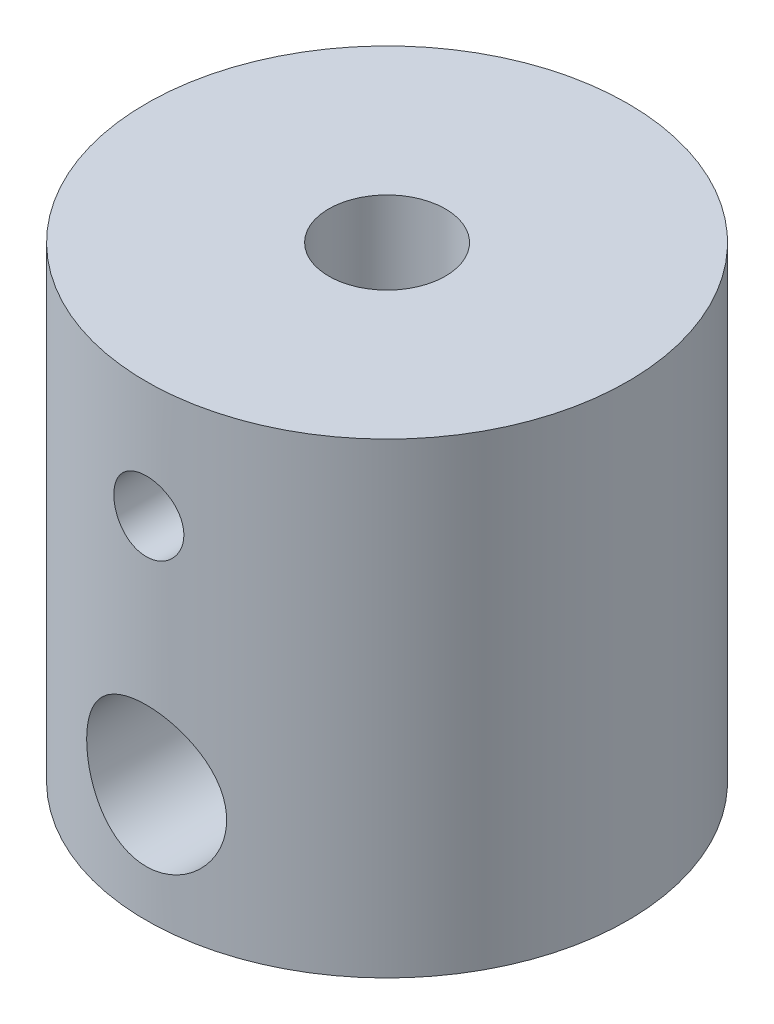
ISO-10303-21;
HEADER;
FILE_DESCRIPTION(('STEP AP214'),'2;1');
FILE_NAME('part.step','',(''),(''),'','','');
FILE_SCHEMA(('AUTOMOTIVE_DESIGN { 1 0 10303 214 1 1 1 1 }'));
ENDSEC;
DATA;
#1=APPLICATION_CONTEXT('core data for automotive mechanical design processes');
#2=APPLICATION_PROTOCOL_DEFINITION('international standard','automotive_design',2000,#1);
#3=PRODUCT_CONTEXT('',#1,'mechanical');
#4=PRODUCT('Part','Part','',(#3));
#5=PRODUCT_RELATED_PRODUCT_CATEGORY('part','',(#4));
#6=PRODUCT_DEFINITION_FORMATION('','',#4);
#7=PRODUCT_DEFINITION_CONTEXT('part definition',#1,'design');
#8=PRODUCT_DEFINITION('design','',#6,#7);
#9=PRODUCT_DEFINITION_SHAPE('','',#8);
#10=(LENGTH_UNIT() NAMED_UNIT(*) SI_UNIT(.MILLI.,.METRE.));
#11=(NAMED_UNIT(*) PLANE_ANGLE_UNIT() SI_UNIT($,.RADIAN.));
#12=(NAMED_UNIT(*) SI_UNIT($,.STERADIAN.) SOLID_ANGLE_UNIT());
#13=UNCERTAINTY_MEASURE_WITH_UNIT(LENGTH_MEASURE(1.E-05),#10,'distance_accuracy_value','');
#14=(GEOMETRIC_REPRESENTATION_CONTEXT(3) GLOBAL_UNCERTAINTY_ASSIGNED_CONTEXT((#13)) GLOBAL_UNIT_ASSIGNED_CONTEXT((#10,
#11,#12)) REPRESENTATION_CONTEXT('',''));
#15=CARTESIAN_POINT('',(0.,0.,0.));
#16=DIRECTION('',(0.,0.,1.));
#17=DIRECTION('',(1.,0.,0.));
#18=AXIS2_PLACEMENT_3D('',#15,#16,#17);
#19=CARTESIAN_POINT('',(0.,0.,0.));
#20=DIRECTION('',(0.,-1.,0.));
#21=DIRECTION('',(0.,0.,-1.));
#22=AXIS2_PLACEMENT_3D('',#19,#20,#21);
#23=CYLINDRICAL_SURFACE('',#22,5.);
#24=CARTESIAN_POINT('',(0.,10.,0.));
#25=DIRECTION('',(0.,-1.,0.));
#26=DIRECTION('',(0.,0.,-1.));
#27=AXIS2_PLACEMENT_3D('',#24,#25,#26);
#28=CIRCLE('',#27,5.);
#29=CARTESIAN_POINT('',(0.,10.,-5.));
#30=VERTEX_POINT('',#29);
#31=EDGE_CURVE('E127',#30,#30,#28,.T.);
#32=ORIENTED_EDGE('',*,*,#31,.F.);
#33=EDGE_LOOP('',(#32));
#34=FACE_BOUND('',#33,.T.);
#35=CARTESIAN_POINT('',(0.,0.,0.));
#36=DIRECTION('',(0.,-1.,0.));
#37=DIRECTION('',(0.,0.,-1.));
#38=AXIS2_PLACEMENT_3D('',#35,#36,#37);
#39=CIRCLE('',#38,5.);
#40=CARTESIAN_POINT('',(0.,0.,-5.));
#41=VERTEX_POINT('',#40);
#42=EDGE_CURVE('E61',#41,#41,#39,.T.);
#43=ORIENTED_EDGE('',*,*,#42,.T.);
#44=EDGE_LOOP('',(#43));
#45=FACE_BOUND('',#44,.T.);
#46=CARTESIAN_POINT('',(-3.,5.,4.));
#47=CARTESIAN_POINT('',(-2.9999999059924,5.07546161036566,3.99999997094658));
#48=CARTESIAN_POINT('',(-2.99714660074499,5.15091995182571,4.00214560778386));
#49=CARTESIAN_POINT('',(-2.98579602023829,5.30118357915588,4.01061905841259));
#50=CARTESIAN_POINT('',(-2.97729658251829,5.37598860368072,4.01694847458097));
#51=CARTESIAN_POINT('',(-2.94350195877,5.59854240080013,4.04185988554313));
#52=CARTESIAN_POINT('',(-2.90991036792577,5.74446616303865,4.06636523363867));
#53=CARTESIAN_POINT('',(-2.82286888064331,6.02619529387303,4.1272446631328));
#54=CARTESIAN_POINT('',(-2.76956233581238,6.16206540972156,4.16353284212727));
#55=CARTESIAN_POINT('',(-2.64505893939301,6.42286717142596,4.24371857831163));
#56=CARTESIAN_POINT('',(-2.57385675138361,6.54779553947816,4.28761840405594));
#57=CARTESIAN_POINT('',(-2.40542341931062,6.79990131024536,4.3845721143975));
#58=CARTESIAN_POINT('',(-2.30607419983945,6.92548608074574,4.43808896832273));
#59=CARTESIAN_POINT('',(-2.08854542159202,7.15952535636891,4.54452303763808));
#60=CARTESIAN_POINT('',(-1.97035175093534,7.26796690142325,4.59743977155758));
#61=CARTESIAN_POINT('',(-1.70284578042267,7.47628246871424,4.70351798165429));
#62=CARTESIAN_POINT('',(-1.55155129309906,7.57396641364106,4.75608869625048));
#63=CARTESIAN_POINT('',(-1.31132430439157,7.69974650858797,4.82570563669468));
#64=CARTESIAN_POINT('',(-1.22900736782604,7.73822411545812,4.84737661360987));
#65=CARTESIAN_POINT('',(-1.06047221299631,7.80779096487914,4.88701002756048));
#66=CARTESIAN_POINT('',(-0.974256618946846,7.83888509171157,4.90497491519086));
#67=CARTESIAN_POINT('',(-0.806968026671437,7.89062746245329,4.9351119388654));
#68=CARTESIAN_POINT('',(-0.726184158740189,7.9119872715291,4.94767216447126));
#69=CARTESIAN_POINT('',(-0.562666348744432,7.94794996135096,4.96892323787741));
#70=CARTESIAN_POINT('',(-0.479933520527565,7.9625566076376,4.97761624192487));
#71=CARTESIAN_POINT('',(-0.313244621267395,7.98478468451609,4.99087754875312));
#72=CARTESIAN_POINT('',(-0.229289227265367,7.9924098423118,4.99544805239181));
#73=CARTESIAN_POINT('',(-0.0609397888852066,8.00056663984718,5.00033941607428));
#74=CARTESIAN_POINT('',(0.0234542099897581,8.00109900129356,5.00066070848407));
#75=CARTESIAN_POINT('',(0.255171183646356,7.99275721772026,4.99565270087357));
#76=CARTESIAN_POINT('',(0.402219957267168,7.97652885035085,4.98590479614142));
#77=CARTESIAN_POINT('',(0.690956248818425,7.92304450631758,4.95416390550291));
#78=CARTESIAN_POINT('',(0.832643369131343,7.8857869733895,4.9321700133334));
#79=CARTESIAN_POINT('',(1.10810607069191,7.79166776699805,4.87769707511975));
#80=CARTESIAN_POINT('',(1.2418309672266,7.73469357980008,4.84515792140775));
#81=CARTESIAN_POINT('',(1.49797933560354,7.60323106554831,4.77219304045846));
#82=CARTESIAN_POINT('',(1.62039986081242,7.52873818986414,4.73176526544935));
#83=CARTESIAN_POINT('',(1.86614789799246,7.35432172038148,4.64075842839173));
#84=CARTESIAN_POINT('',(1.98783715480756,7.2524233514645,4.58954363323803));
#85=CARTESIAN_POINT('',(2.2134294892317,7.03119178989514,4.48511110796774));
#86=CARTESIAN_POINT('',(2.31730807434112,6.91183500028095,4.43189074054161));
#87=CARTESIAN_POINT('',(2.51649670159325,6.64269317960225,4.32222149525339));
#88=CARTESIAN_POINT('',(2.60941864927586,6.4909848446704,4.26611322583746));
#89=CARTESIAN_POINT('',(2.76794435835452,6.17058753897334,4.16501759300692));
#90=CARTESIAN_POINT('',(2.83359844351372,6.00193056868576,4.12000980621702));
#91=CARTESIAN_POINT('',(2.92154993808436,5.69521273550437,4.05791730375361));
#92=CARTESIAN_POINT('',(2.95055806318484,5.55991873420767,4.03667777278559));
#93=CARTESIAN_POINT('',(2.98961745817055,5.28525278059874,4.00784301513237));
#94=CARTESIAN_POINT('',(2.9996907751055,5.1458857631155,4.00023192044755));
#95=CARTESIAN_POINT('',(3.00029561322377,4.86689663103837,3.9997782882838));
#96=CARTESIAN_POINT('',(2.99080006076193,4.72727443039828,4.00695621149423));
#97=CARTESIAN_POINT('',(2.95280584471632,4.45202532768623,4.03503040875294));
#98=CARTESIAN_POINT('',(2.92429216045109,4.31640167218009,4.05593752603304));
#99=CARTESIAN_POINT('',(2.84976612867927,4.05257078445052,4.10863539286051));
#100=CARTESIAN_POINT('',(2.80377564381491,3.92435451586245,4.14041253958232));
#101=CARTESIAN_POINT('',(2.69592568264801,3.67704477969248,4.21143069058874));
#102=CARTESIAN_POINT('',(2.63406022035171,3.5579547754061,4.25067450889246));
#103=CARTESIAN_POINT('',(2.48334675803862,3.3095189047537,4.34073681424694));
#104=CARTESIAN_POINT('',(2.391645038527,3.18219456767056,4.39236652981539));
#105=CARTESIAN_POINT('',(2.18975614095891,2.94343279605459,4.49643335252963));
#106=CARTESIAN_POINT('',(2.07955127457131,2.83201075390556,4.54887118822612));
#107=CARTESIAN_POINT('',(1.82651475528323,2.61353600868425,4.65671991538655));
#108=CARTESIAN_POINT('',(1.68130397020029,2.50893529423711,4.71163080343122));
#109=CARTESIAN_POINT('',(1.44944631278512,2.37184550227661,4.78599458202112));
#110=CARTESIAN_POINT('',(1.36978605711653,2.32943799786309,4.80945640676867));
#111=CARTESIAN_POINT('',(1.20623656162325,2.25169611652151,4.85305400686526));
#112=CARTESIAN_POINT('',(1.12235002598574,2.2163572868813,4.87319187464059));
#113=CARTESIAN_POINT('',(0.957140698774941,2.15552035676558,4.90820667253681));
#114=CARTESIAN_POINT('',(0.876069467337989,2.12949628153821,4.9233583127873));
#115=CARTESIAN_POINT('',(0.711460619981308,2.08433501839092,4.94982497459132));
#116=CARTESIAN_POINT('',(0.627924414708837,2.06519397112009,4.96114214594589));
#117=CARTESIAN_POINT('',(0.459119615082284,2.0340996902869,4.9795990393125));
#118=CARTESIAN_POINT('',(0.37385224130405,2.02214156263945,4.98674160560362));
#119=CARTESIAN_POINT('',(0.202384159163477,2.00559323834099,4.99664216975595));
#120=CARTESIAN_POINT('',(0.116183573945421,2.00100208121105,4.99940073918633));
#121=CARTESIAN_POINT('',(-0.119519384080578,1.99867171024059,5.00079353601933));
#122=CARTESIAN_POINT('',(-0.269213134971584,2.0083989254259,4.9949361975757));
#123=CARTESIAN_POINT('',(-0.564325544477554,2.04978205414894,4.97026391444784));
#124=CARTESIAN_POINT('',(-0.709744155455479,2.08143821194009,4.95144882543497));
#125=CARTESIAN_POINT('',(-0.990283617430275,2.16444057064628,4.90298726022977));
#126=CARTESIAN_POINT('',(-1.1255320564868,2.215463439549,4.87351900635897));
#127=CARTESIAN_POINT('',(-1.38556595318151,2.33528094176348,4.8060670798365));
#128=CARTESIAN_POINT('',(-1.51034905620296,2.40407956034356,4.76808149787885));
#129=CARTESIAN_POINT('',(-1.76052652812014,2.56584990689575,4.68186861678971));
#130=CARTESIAN_POINT('',(-1.88451663454097,2.66063506352805,4.63297714592576));
#131=CARTESIAN_POINT('',(-2.11579577789689,2.86750842456549,4.5320378935883));
#132=CARTESIAN_POINT('',(-2.22306604531463,2.97961579766439,4.47998665474642));
#133=CARTESIAN_POINT('',(-2.43181699852643,3.23456104337874,4.37056449731607));
#134=CARTESIAN_POINT('',(-2.53083841179814,3.37949308448909,4.31335603990194));
#135=CARTESIAN_POINT('',(-2.70314606061125,3.68700957259526,4.20752457767503));
#136=CARTESIAN_POINT('',(-2.77644567607668,3.84958478419803,4.15889711577767));
#137=CARTESIAN_POINT('',(-2.86193484914579,4.09662255268763,4.10004730463765));
#138=CARTESIAN_POINT('',(-2.88571236613332,4.17565859129722,4.0832950867822));
#139=CARTESIAN_POINT('',(-2.92679381745552,4.33613044180016,4.05395087655969));
#140=CARTESIAN_POINT('',(-2.94410184772356,4.41756469998732,4.04135625254712));
#141=CARTESIAN_POINT('',(-2.97191221271433,4.58204655069406,4.0209497222627));
#142=CARTESIAN_POINT('',(-2.98242533831514,4.66509136837172,4.01313023377049));
#143=CARTESIAN_POINT('',(-2.99646884485439,4.83209221666361,4.00265571377826));
#144=CARTESIAN_POINT('',(-3.00000010458449,4.91604813126241,4.00000003232225));
#145=CARTESIAN_POINT('',(-3.,5.,4.));
#146=B_SPLINE_CURVE_WITH_KNOTS('',3,(#46,#47,#48,#49,#50,#51,#52,#53,#54,#55,#56,#57,#58,#59,
#60,#61,#62,#63,#64,#65,#66,#67,#68,#69,#70,#71,#72,#73,#74,#75,#76,#77,#78,#79,#80,#81,#82,#83,
#84,#85,#86,#87,#88,#89,#90,#91,#92,#93,#94,#95,#96,#97,#98,#99,#100,#101,#102,#103,#104,#105,
#106,#107,#108,#109,#110,#111,#112,#113,#114,#115,#116,#117,#118,#119,#120,#121,#122,#123,#124,
#125,#126,#127,#128,#129,#130,#131,#132,#133,#134,#135,#136,#137,#138,#139,#140,#141,#142,#143,
#144,#145),.UNSPECIFIED.,.T.,.F.,(4,2,2,2,2,2,2,2,2,2,2,2,2,2,2,2,2,2,2,2,2,2,2,2,2,2,2,2,2,2,2,
2,2,2,2,2,2,2,2,2,2,2,2,2,2,2,2,2,2,4),(0.,0.226288173517879,0.452663065091108,
0.905305714765857,1.35471981612576,1.80426809059901,2.30878181396805,2.81367513819685,
3.37309572088444,3.65297634398311,3.93267130287329,4.18580566749444,4.43879871451846,
4.69165661737851,4.94448879122708,5.38694235003539,5.82942865693065,6.27448283989929,
6.71965270654932,7.21799594026829,7.71701907227943,8.27387316194679,8.82969494223662,
9.24786570023494,9.66554925202079,10.0838110593649,10.5024036052238,10.9204742264512,
11.3387027222345,11.8323285087813,12.3264288987103,12.884776299373,13.1641700331408,
13.4433872125907,13.7024631857776,13.9613936663243,14.2201475237758,14.4788676430947,
14.9267946196281,15.3747265854331,15.8154875864153,16.2563474905318,16.7450674536299,
17.2343321574792,17.7856420979722,18.3366648323362,18.5890061072372,18.8411873492279,
19.0929671157917,19.3447151893882),.UNSPECIFIED.);
#147=CARTESIAN_POINT('',(-3.,5.,4.));
#148=VERTEX_POINT('',#147);
#149=EDGE_CURVE('E99',#148,#148,#146,.T.);
#150=ORIENTED_EDGE('',*,*,#149,.F.);
#151=EDGE_LOOP('',(#150));
#152=FACE_BOUND('',#151,.T.);
#153=ADVANCED_FACE('F49',(#34,#45,#152),#23,.F.);
#154=CARTESIAN_POINT('',(0.,0.,0.));
#155=DIRECTION('',(0.,-1.,0.));
#156=DIRECTION('',(0.,0.,-1.));
#157=AXIS2_PLACEMENT_3D('',#154,#155,#156);
#158=CYLINDRICAL_SURFACE('',#157,10.31875);
#159=CARTESIAN_POINT('',(0.,0.,0.));
#160=DIRECTION('',(0.,-1.,0.));
#161=DIRECTION('',(0.,0.,-1.));
#162=AXIS2_PLACEMENT_3D('',#159,#160,#161);
#163=CIRCLE('',#162,10.31875);
#164=CARTESIAN_POINT('',(0.,0.,-10.31875));
#165=VERTEX_POINT('',#164);
#166=EDGE_CURVE('E65',#165,#165,#163,.T.);
#167=ORIENTED_EDGE('',*,*,#166,.F.);
#168=EDGE_LOOP('',(#167));
#169=FACE_BOUND('',#168,.T.);
#170=CARTESIAN_POINT('',(0.,20.,0.));
#171=DIRECTION('',(0.,-1.,0.));
#172=DIRECTION('',(0.,0.,-1.));
#173=AXIS2_PLACEMENT_3D('',#170,#171,#172);
#174=CIRCLE('',#173,10.31875);
#175=CARTESIAN_POINT('',(0.,20.,-10.31875));
#176=VERTEX_POINT('',#175);
#177=EDGE_CURVE('E70',#176,#176,#174,.T.);
#178=ORIENTED_EDGE('',*,*,#177,.T.);
#179=EDGE_LOOP('',(#178));
#180=FACE_BOUND('',#179,.T.);
#181=CARTESIAN_POINT('',(0.,13.5,10.31875));
#182=CARTESIAN_POINT('',(0.0837819607339596,13.5000034776501,10.318748686599));
#183=CARTESIAN_POINT('',(0.167613281912517,13.5070431087532,10.3177189020575));
#184=CARTESIAN_POINT('',(0.332934794385833,13.5350096902615,10.3137099847073));
#185=CARTESIAN_POINT('',(0.414422590295902,13.5559503573273,10.3107289265461));
#186=CARTESIAN_POINT('',(0.572640425147574,13.611081833009,10.3031526306588));
#187=CARTESIAN_POINT('',(0.649373933886186,13.6452628431548,10.2985585868519));
#188=CARTESIAN_POINT('',(0.7960037629053,13.72588126249,10.2882646154186));
#189=CARTESIAN_POINT('',(0.865901074759324,13.772316890553,10.2825648485334));
#190=CARTESIAN_POINT('',(0.997400776906768,13.876490538446,10.2706468892861));
#191=CARTESIAN_POINT('',(1.05894560433755,13.934300866438,10.2644255345824));
#192=CARTESIAN_POINT('',(1.17149683095147,14.059427331708,10.2521904826792));
#193=CARTESIAN_POINT('',(1.22250263841507,14.1267440023682,10.2461767971553));
#194=CARTESIAN_POINT('',(1.31275022390557,14.2693566653012,10.2350072332995));
#195=CARTESIAN_POINT('',(1.35193664144488,14.3446880382892,10.2298554405714));
#196=CARTESIAN_POINT('',(1.41707935548035,14.5009504893511,10.2210359010739));
#197=CARTESIAN_POINT('',(1.44303632888573,14.5818812806796,10.2173680783763));
#198=CARTESIAN_POINT('',(1.48080527979091,14.7464412641317,10.2119627100376));
#199=CARTESIAN_POINT('',(1.49271556425705,14.8300474449268,10.2102117553026));
#200=CARTESIAN_POINT('',(1.50235752535367,14.998088690434,10.2087976098725));
#201=CARTESIAN_POINT('',(1.5000899672862,15.082523710161,10.2091343064887));
#202=CARTESIAN_POINT('',(1.48152101950504,15.2491332506721,10.2118451564076));
#203=CARTESIAN_POINT('',(1.46532887870183,15.3313202426047,10.2142034483061));
#204=CARTESIAN_POINT('',(1.41954130718723,15.4917982243243,10.2206670007986));
#205=CARTESIAN_POINT('',(1.38994551847912,15.5700891099885,10.2247723080532));
#206=CARTESIAN_POINT('',(1.31807639017003,15.7208862732386,10.2342849419976));
#207=CARTESIAN_POINT('',(1.27575653818824,15.7933700705531,10.2396970310405));
#208=CARTESIAN_POINT('',(1.1796737418992,15.9302488373677,10.2512099375101));
#209=CARTESIAN_POINT('',(1.12591009161906,15.9946433074437,10.2573107974164));
#210=CARTESIAN_POINT('',(1.00786501804294,16.1141488556154,10.2695840038803));
#211=CARTESIAN_POINT('',(0.943489617746688,16.1691671338979,10.2757564839731));
#212=CARTESIAN_POINT('',(0.806369370664086,16.2676327185068,10.2874241983379));
#213=CARTESIAN_POINT('',(0.733624491146089,16.3110799795787,10.2929194299611));
#214=CARTESIAN_POINT('',(0.58175157226227,16.3851740539305,10.3026187289702));
#215=CARTESIAN_POINT('',(0.502620123593875,16.4158139757,10.3068221008972));
#216=CARTESIAN_POINT('',(0.340260297529394,16.4633443380821,10.3134581796291));
#217=CARTESIAN_POINT('',(0.257032180462146,16.4802356511773,10.3158909987916));
#218=CARTESIAN_POINT('',(0.0896427745060789,16.4996665366038,10.3186970347258));
#219=CARTESIAN_POINT('',(0.00549659682360666,16.5023337398306,10.3190885669576));
#220=CARTESIAN_POINT('',(-0.162041766537512,16.4935790776358,10.317817690034));
#221=CARTESIAN_POINT('',(-0.245433974027722,16.4821576211064,10.3161553404881));
#222=CARTESIAN_POINT('',(-0.408712587049516,16.4456559681444,10.3109748191207));
#223=CARTESIAN_POINT('',(-0.48861312456975,16.4206376900583,10.3074650624411));
#224=CARTESIAN_POINT('',(-0.64308534216285,16.3577176832638,10.2989821042169));
#225=CARTESIAN_POINT('',(-0.717656785100219,16.31981538167,10.2940088375989));
#226=CARTESIAN_POINT('',(-0.859916982007754,16.2319019492633,10.2831063049776));
#227=CARTESIAN_POINT('',(-0.92755501348206,16.1818095385581,10.2771707150889));
#228=CARTESIAN_POINT('',(-1.05350980648317,16.0710513491078,10.2650246016984));
#229=CARTESIAN_POINT('',(-1.11182606056964,16.0103849951349,10.258814063253));
#230=CARTESIAN_POINT('',(-1.21794403448247,15.8796339782862,10.2467602483491));
#231=CARTESIAN_POINT('',(-1.26566038193787,15.8094796836956,10.2409202067074));
#232=CARTESIAN_POINT('',(-1.34863136154721,15.6620768663482,10.2303251129395));
#233=CARTESIAN_POINT('',(-1.38388631405051,15.5848285260248,10.225570032923));
#234=CARTESIAN_POINT('',(-1.44080024657093,15.4256891229112,10.2177064181395));
#235=CARTESIAN_POINT('',(-1.46250478771679,15.3438146387155,10.2145923712242));
#236=CARTESIAN_POINT('',(-1.49184716298129,15.1775341423672,10.2103485299712));
#237=CARTESIAN_POINT('',(-1.49948590447492,15.0931282938683,10.2092186076391));
#238=CARTESIAN_POINT('',(-1.50045923509721,14.9250316213542,10.2090755283487));
#239=CARTESIAN_POINT('',(-1.49392803047329,14.8413415602766,10.2100425111611));
#240=CARTESIAN_POINT('',(-1.46703378739175,14.676263256137,10.2139412181737));
#241=CARTESIAN_POINT('',(-1.4466707658538,14.5948750102596,10.2168729399705));
#242=CARTESIAN_POINT('',(-1.39273731548527,14.4367439955743,10.2243640090385));
#243=CARTESIAN_POINT('',(-1.35917569527644,14.3599981677941,10.2289222705847));
#244=CARTESIAN_POINT('',(-1.27981102487928,14.2132050383744,10.2391542230725));
#245=CARTESIAN_POINT('',(-1.2340076112631,14.143157935687,10.2448279471282));
#246=CARTESIAN_POINT('',(-1.13096980910404,14.011067871719,10.2567156077661));
#247=CARTESIAN_POINT('',(-1.07363587406262,13.9491029516819,10.2629339622892));
#248=CARTESIAN_POINT('',(-0.949374737227707,13.8356254923594,10.2751729201099));
#249=CARTESIAN_POINT('',(-0.882445303334387,13.7841153918221,10.2811934769942));
#250=CARTESIAN_POINT('',(-0.74048874256042,13.6927743664313,10.292393750887));
#251=CARTESIAN_POINT('',(-0.665421658441391,13.6530050037279,10.2975689743244));
#252=CARTESIAN_POINT('',(-0.509634972677335,13.5866975599105,10.3064512211945));
#253=CARTESIAN_POINT('',(-0.428921384273434,13.5601456403503,10.3101597793617));
#254=CARTESIAN_POINT('',(-0.289861820830573,13.5271169837284,10.3148347928169));
#255=CARTESIAN_POINT('',(-0.232378193461981,13.5169634683008,10.3162955330485));
#256=CARTESIAN_POINT('',(-0.116604342148973,13.5034038043583,10.3182535882664));
#257=CARTESIAN_POINT('',(-0.0583141273410549,13.4999975794774,10.3187509141566));
#258=CARTESIAN_POINT('',(0.,13.5,10.31875));
#259=B_SPLINE_CURVE_WITH_KNOTS('',3,(#181,#182,#183,#184,#185,#186,#187,#188,#189,#190,#191,
#192,#193,#194,#195,#196,#197,#198,#199,#200,#201,#202,#203,#204,#205,#206,#207,#208,#209,#210,
#211,#212,#213,#214,#215,#216,#217,#218,#219,#220,#221,#222,#223,#224,#225,#226,#227,#228,#229,
#230,#231,#232,#233,#234,#235,#236,#237,#238,#239,#240,#241,#242,#243,#244,#245,#246,#247,#248,
#249,#250,#251,#252,#253,#254,#255,#256,#257,#258),.UNSPECIFIED.,.T.,.F.,(4,2,2,2,2,2,2,2,2,2,2,
2,2,2,2,2,2,2,2,2,2,2,2,2,2,2,2,2,2,2,2,2,2,2,2,2,2,2,4),(0.,0.251132813055181,
0.502513797115294,0.753709101870635,1.00486791716148,1.25767815751196,1.51050258818905,
1.7644934555948,2.01847132577833,2.27066095833277,2.52283697812665,2.77305235098082,
3.02327440720741,3.27442249811505,3.52558608695035,3.77910692814728,4.03262876085601,
4.28628683624193,4.53992881330884,4.79129102017873,5.04264593198696,5.29286567853072,
5.54309655249654,5.79504394528558,6.04700504841755,6.30092728037056,6.55484298418271,
6.80790027216983,7.06094123503463,7.31159606870804,7.56225059577,7.81273812145553,
8.06323308430789,8.31599142575106,8.5688086593928,8.82292890019706,9.07678251872959,
9.25157857819687,9.42637265930605),.UNSPECIFIED.);
#260=CARTESIAN_POINT('',(0.,13.5,10.31875));
#261=VERTEX_POINT('',#260);
#262=EDGE_CURVE('E80',#261,#261,#259,.T.);
#263=ORIENTED_EDGE('',*,*,#262,.F.);
#264=EDGE_LOOP('',(#263));
#265=FACE_BOUND('',#264,.T.);
#266=CARTESIAN_POINT('',(0.,2.,10.31875));
#267=CARTESIAN_POINT('',(0.164809339708518,2.00000260411524,10.3187482156861));
#268=CARTESIAN_POINT('',(0.329645236370561,2.01362625223754,10.3147634656808));
#269=CARTESIAN_POINT('',(0.65453164201993,2.06764112286197,10.2992560877628));
#270=CARTESIAN_POINT('',(0.81458045299665,2.10804172835734,10.2877308175722));
#271=CARTESIAN_POINT('',(1.12515880789111,2.21415837713034,10.2584079399792));
#272=CARTESIAN_POINT('',(1.27570153997501,2.27983840917499,10.2406192580346));
#273=CARTESIAN_POINT('',(1.56363701331181,2.43450585262916,10.200627348723));
#274=CARTESIAN_POINT('',(1.70102824471204,2.52349593576811,10.1784236153861));
#275=CARTESIAN_POINT('',(1.9624883297935,2.72480309347405,10.1313046885095));
#276=CARTESIAN_POINT('',(2.08614980938856,2.83763684958135,10.1063365130543));
#277=CARTESIAN_POINT('',(2.31308869397159,3.08232631327685,10.0568256112728));
#278=CARTESIAN_POINT('',(2.41636291630475,3.21418498529229,10.0322829519185));
#279=CARTESIAN_POINT('',(2.60169339010749,3.49657152878148,9.98584688734821));
#280=CARTESIAN_POINT('',(2.68326071618413,3.64743217407339,9.96401962363506));
#281=CARTESIAN_POINT('',(2.81970476394612,3.96146537475487,9.92627391883909));
#282=CARTESIAN_POINT('',(2.87458745682366,4.12463516629099,9.91035415603));
#283=CARTESIAN_POINT('',(2.95465094193823,4.45409763274911,9.88677660234138));
#284=CARTESIAN_POINT('',(2.98057928672853,4.62019340716631,9.87891132751446));
#285=CARTESIAN_POINT('',(3.00433142331236,4.95454926035329,9.87171524575314));
#286=CARTESIAN_POINT('',(3.00216156245194,5.12280884174261,9.87238251132915));
#287=CARTESIAN_POINT('',(2.97036785822354,5.45070945042278,9.8819917000496));
#288=CARTESIAN_POINT('',(2.94167105481681,5.61044989367503,9.89065419738246));
#289=CARTESIAN_POINT('',(2.85913208579218,5.92274380747966,9.91482709518641));
#290=CARTESIAN_POINT('',(2.80528757485632,6.07529660623893,9.93033813435678));
#291=CARTESIAN_POINT('',(2.67327821241828,6.37119505794485,9.96668986679346));
#292=CARTESIAN_POINT('',(2.59480575119463,6.51439492322032,9.98759734133766));
#293=CARTESIAN_POINT('',(2.41598201759831,6.78590899337859,10.032353012791));
#294=CARTESIAN_POINT('',(2.31562572355983,6.91421977130317,10.0562018841135));
#295=CARTESIAN_POINT('',(2.09123959519477,7.15758300323984,10.1052951210385));
#296=CARTESIAN_POINT('',(1.96643769283189,7.27192110249352,10.1305575942754));
#297=CARTESIAN_POINT('',(1.69911725268762,7.47820594227385,10.1788026416105));
#298=CARTESIAN_POINT('',(1.55659773152913,7.57015143910998,10.2017850890335));
#299=CARTESIAN_POINT('',(1.25664515614381,7.72943961629529,10.2430693038246));
#300=CARTESIAN_POINT('',(1.09912823116441,7.79663230325611,10.2613423397371));
#301=CARTESIAN_POINT('',(0.774376783585014,7.90336585193613,10.2909418456767));
#302=CARTESIAN_POINT('',(0.607144812826127,7.94291393978165,10.3022701309233));
#303=CARTESIAN_POINT('',(0.27378998917986,7.99206603214321,10.316420244371));
#304=CARTESIAN_POINT('',(0.107821475672511,8.00263903563725,10.3195172365743));
#305=CARTESIAN_POINT('',(-0.223525049255154,7.9962452510305,10.3176584164921));
#306=CARTESIAN_POINT('',(-0.388903131695083,7.97928189521353,10.3127036078273));
#307=CARTESIAN_POINT('',(-0.710774438262296,7.91908404940463,10.2954774370871));
#308=CARTESIAN_POINT('',(-0.867381284338873,7.87640834016098,10.2833617978582));
#309=CARTESIAN_POINT('',(-1.17118421651959,7.76666269437771,10.2532069748765));
#310=CARTESIAN_POINT('',(-1.31837919598625,7.69958989543239,10.2351670960824));
#311=CARTESIAN_POINT('',(-1.602803533405,7.54127876614574,10.1945443185533));
#312=CARTESIAN_POINT('',(-1.73973949104261,7.44953750529714,10.1718695417646));
#313=CARTESIAN_POINT('',(-1.99660615335673,7.24511064246976,10.1245864910467));
#314=CARTESIAN_POINT('',(-2.11653284033902,7.13242010662035,10.0999777624325));
#315=CARTESIAN_POINT('',(-2.34019207722368,6.88474724770741,10.050556358394));
#316=CARTESIAN_POINT('',(-2.44323650274532,6.74913794232412,10.0257651294251));
#317=CARTESIAN_POINT('',(-2.62514498957025,6.46201590773114,9.97968201140453));
#318=CARTESIAN_POINT('',(-2.704009828135,6.31050368993646,9.95839000987919));
#319=CARTESIAN_POINT('',(-2.83475572157265,5.99645904468501,9.92196416824371));
#320=CARTESIAN_POINT('',(-2.8867744786621,5.83398778772747,9.9067989905632));
#321=CARTESIAN_POINT('',(-2.96257912826892,5.50207448386907,9.88439775474818));
#322=CARTESIAN_POINT('',(-2.98637395748199,5.33263466105477,9.87715918682391));
#323=CARTESIAN_POINT('',(-3.00447352362688,4.99871141814798,9.87166744941792));
#324=CARTESIAN_POINT('',(-2.99989517109239,4.83429331176663,9.87307394847626));
#325=CARTESIAN_POINT('',(-2.96402270838302,4.50868041251158,9.88390177599681));
#326=CARTESIAN_POINT('',(-2.93272954968522,4.34748550504937,9.89332281901222));
#327=CARTESIAN_POINT('',(-2.84501664544716,4.03459859768704,9.91889704675834));
#328=CARTESIAN_POINT('',(-2.78887556389646,3.8828219205278,9.93497544521476));
#329=CARTESIAN_POINT('',(-2.65327633068819,3.59072151730623,9.97204314168065));
#330=CARTESIAN_POINT('',(-2.57381393250293,3.45039988302059,9.99303333392673));
#331=CARTESIAN_POINT('',(-2.39061947255502,3.17996638200597,10.0384622597086));
#332=CARTESIAN_POINT('',(-2.28614566389075,3.05037273687777,10.0629948803548));
#333=CARTESIAN_POINT('',(-2.05725079751584,2.8101940672653,10.112270010532));
#334=CARTESIAN_POINT('',(-1.93282467071614,2.6996138881794,10.1370125718836));
#335=CARTESIAN_POINT('',(-1.66352720565006,2.49765014410651,10.1847164671136));
#336=CARTESIAN_POINT('',(-1.51819628961165,2.40686232244762,10.207612064002));
#337=CARTESIAN_POINT('',(-1.21366777641137,2.25114191236074,10.2482752317567));
#338=CARTESIAN_POINT('',(-1.05447743613254,2.18619589105942,10.2660454655223));
#339=CARTESIAN_POINT('',(-0.747027153378267,2.09060356082421,10.2926848278426));
#340=CARTESIAN_POINT('',(-0.599839856567203,2.05671532871959,10.3023813373372));
#341=CARTESIAN_POINT('',(-0.301775436038093,2.01141398268262,10.3154142799912));
#342=CARTESIAN_POINT('',(-0.150898849590458,1.99999761568128,10.3187516337115));
#343=CARTESIAN_POINT('',(0.,2.,10.31875));
#344=B_SPLINE_CURVE_WITH_KNOTS('',3,(#266,#267,#268,#269,#270,#271,#272,#273,#274,#275,#276,
#277,#278,#279,#280,#281,#282,#283,#284,#285,#286,#287,#288,#289,#290,#291,#292,#293,#294,#295,
#296,#297,#298,#299,#300,#301,#302,#303,#304,#305,#306,#307,#308,#309,#310,#311,#312,#313,#314,
#315,#316,#317,#318,#319,#320,#321,#322,#323,#324,#325,#326,#327,#328,#329,#330,#331,#332,#333,
#334,#335,#336,#337,#338,#339,#340,#341,#342,#343),.UNSPECIFIED.,.T.,.F.,(4,2,2,2,2,2,2,2,2,2,2,
2,2,2,2,2,2,2,2,2,2,2,2,2,2,2,2,2,2,2,2,2,2,2,2,2,2,2,4),(0.,0.493873997059169,
0.987921145535341,1.48126709971997,1.97466962452711,2.48012375385357,2.98565672733546,
3.50176243882254,4.01775260866783,4.52008841990524,5.02231075615293,5.50761954578886,
5.99297360518815,6.48464880908287,6.97643695624753,7.4874496173683,7.99849065378578,
8.51257937497536,9.02653366626779,9.52307728083395,10.0195590082152,10.5056218670792,
10.9917417720136,11.4886423401052,11.9856600843868,12.4995537381869,13.0134308709597,
13.5246452884892,14.0356977941717,14.5267639721703,15.0178126610388,15.5034886332393,
15.9892530960444,16.4917511925501,16.9943771566599,17.5105105150347,18.0263752295891,
18.4786299917694,18.9308192798927),.UNSPECIFIED.);
#345=CARTESIAN_POINT('',(0.,2.,10.31875));
#346=VERTEX_POINT('',#345);
#347=EDGE_CURVE('E10',#346,#346,#344,.T.);
#348=ORIENTED_EDGE('',*,*,#347,.F.);
#349=EDGE_LOOP('',(#348));
#350=FACE_BOUND('',#349,.T.);
#351=ADVANCED_FACE('F104',(#169,#180,#265,#350),#158,.T.);
#352=CARTESIAN_POINT('',(0.,0.,0.));
#353=DIRECTION('',(0.,-1.,0.));
#354=DIRECTION('',(0.,0.,-1.));
#355=AXIS2_PLACEMENT_3D('',#352,#353,#354);
#356=CYLINDRICAL_SURFACE('',#355,2.5);
#357=CARTESIAN_POINT('',(0.,20.,0.));
#358=DIRECTION('',(0.,-1.,0.));
#359=DIRECTION('',(0.,0.,-1.));
#360=AXIS2_PLACEMENT_3D('',#357,#358,#359);
#361=CIRCLE('',#360,2.5);
#362=CARTESIAN_POINT('',(0.,20.,-2.5));
#363=VERTEX_POINT('',#362);
#364=EDGE_CURVE('E135',#363,#363,#361,.T.);
#365=ORIENTED_EDGE('',*,*,#364,.F.);
#366=EDGE_LOOP('',(#365));
#367=FACE_BOUND('',#366,.T.);
#368=CARTESIAN_POINT('',(0.,10.,0.));
#369=DIRECTION('',(0.,-1.,0.));
#370=DIRECTION('',(0.,0.,-1.));
#371=AXIS2_PLACEMENT_3D('',#368,#369,#370);
#372=CIRCLE('',#371,2.5);
#373=CARTESIAN_POINT('',(0.,10.,-2.5));
#374=VERTEX_POINT('',#373);
#375=EDGE_CURVE('E132',#374,#374,#372,.T.);
#376=ORIENTED_EDGE('',*,*,#375,.T.);
#377=EDGE_LOOP('',(#376));
#378=FACE_BOUND('',#377,.T.);
#379=CARTESIAN_POINT('',(-1.5,15.,2.));
#380=CARTESIAN_POINT('',(-1.50000404108592,15.0754789752896,1.99999416642511));
#381=CARTESIAN_POINT('',(-1.49426852824013,15.1509384340798,2.00433633903481));
#382=CARTESIAN_POINT('',(-1.47174965152787,15.2993239039622,2.02092590613883));
#383=CARTESIAN_POINT('',(-1.45495475788936,15.3722471873851,2.03318155043097));
#384=CARTESIAN_POINT('',(-1.41143486335795,15.5130836416773,2.0636233903473));
#385=CARTESIAN_POINT('',(-1.3847815450315,15.5810288380353,2.0817666618312));
#386=CARTESIAN_POINT('',(-1.32252909283019,15.7114374533679,2.12185904995836));
#387=CARTESIAN_POINT('',(-1.28692729054693,15.7738992296951,2.14380930122416));
#388=CARTESIAN_POINT('',(-1.20271292747644,15.8999490166641,2.19228594587542));
#389=CARTESIAN_POINT('',(-1.15304179435289,15.9627409571239,2.21904371037662));
#390=CARTESIAN_POINT('',(-1.04426801309985,16.0797647627418,2.27226229431061));
#391=CARTESIAN_POINT('',(-0.985158296729613,16.1339901516708,2.29872287517103));
#392=CARTESIAN_POINT('',(-0.851442367411701,16.2381338097097,2.35175567858734));
#393=CARTESIAN_POINT('',(-0.775851995162547,16.2869544636698,2.37803133577818));
#394=CARTESIAN_POINT('',(-0.615654228271656,16.3708097224444,2.42443786983179));
#395=CARTESIAN_POINT('',(-0.531055196626328,16.4058569741227,2.44457437988735));
#396=CARTESIAN_POINT('',(-0.363771406742664,16.4575959228127,2.4747098780044));
#397=CARTESIAN_POINT('',(-0.281674698130913,16.4757203609673,2.4854930393917));
#398=CARTESIAN_POINT('',(-0.114970509382706,16.4979428028631,2.49874939277545));
#399=CARTESIAN_POINT('',(-0.0303654624001517,16.5020539780001,2.50123038813308));
#400=CARTESIAN_POINT('',(0.127637283737311,16.4963862526575,2.49783372711539));
#401=CARTESIAN_POINT('',(0.201123832865636,16.4882664738307,2.49295437513726));
#402=CARTESIAN_POINT('',(0.345464269151769,16.4615202043519,2.47707997553857));
#403=CARTESIAN_POINT('',(0.416317961051203,16.4428929360928,2.46608447529309));
#404=CARTESIAN_POINT('',(0.554056780469081,16.3958344372962,2.43884907201719));
#405=CARTESIAN_POINT('',(0.620916491037619,16.367346938861,2.42257910450824));
#406=CARTESIAN_POINT('',(0.748988660115613,16.3016153837745,2.38609637638748));
#407=CARTESIAN_POINT('',(0.810199646208012,16.264369052941,2.36588259201812));
#408=CARTESIAN_POINT('',(0.933074267143201,16.1771609071955,2.32037925976362));
#409=CARTESIAN_POINT('',(0.993918663198195,16.1262116882643,2.2947718295215));
#410=CARTESIAN_POINT('',(1.10671465909275,16.0155958821398,2.24255554245601));
#411=CARTESIAN_POINT('',(1.1586540130834,15.9559174965255,2.21594536703375));
#412=CARTESIAN_POINT('',(1.25824837767417,15.8213465938364,2.16111075123946));
#413=CARTESIAN_POINT('',(1.30470933188632,15.7454924234605,2.13305661385124));
#414=CARTESIAN_POINT('',(1.38397217194232,15.5852937683634,2.08250879557267));
#415=CARTESIAN_POINT('',(1.41679921962189,15.5009652838744,2.0600049029882));
#416=CARTESIAN_POINT('',(1.46077497064842,15.3476063681047,2.02895865196731));
#417=CARTESIAN_POINT('',(1.47527903312665,15.2799593677034,2.01833888618316));
#418=CARTESIAN_POINT('',(1.49480872755284,15.1426263897005,2.00392150777558));
#419=CARTESIAN_POINT('',(1.49984538302907,15.0729428795154,2.00011596115116));
#420=CARTESIAN_POINT('',(1.50014781114183,14.9334483175643,1.99988914321323));
#421=CARTESIAN_POINT('',(1.49540004697659,14.8636372227848,2.00347810223984));
#422=CARTESIAN_POINT('',(1.47640290574941,14.7260126562514,2.01751520788652));
#423=CARTESIAN_POINT('',(1.46214601830139,14.6582008077597,2.02796877613213));
#424=CARTESIAN_POINT('',(1.42488312618657,14.5262854205202,2.054317683331));
#425=CARTESIAN_POINT('',(1.40188805257362,14.4621773634678,2.07020622092812));
#426=CARTESIAN_POINT('',(1.34796261057072,14.3385222842698,2.10571539417587));
#427=CARTESIAN_POINT('',(1.31702924888212,14.278976993634,2.12533743689999));
#428=CARTESIAN_POINT('',(1.24167439558512,14.1547599174878,2.17036819177737));
#429=CARTESIAN_POINT('',(1.19582663060303,14.0910991649034,2.19618239397369));
#430=CARTESIAN_POINT('',(1.09487395518701,13.9717145151505,2.2482175480362));
#431=CARTESIAN_POINT('',(1.03976018672402,13.9159983078309,2.27443886711455));
#432=CARTESIAN_POINT('',(0.913274837212766,13.8067759926496,2.32835625910913));
#433=CARTESIAN_POINT('',(0.840721108780191,13.7544992733942,2.3558007587587));
#434=CARTESIAN_POINT('',(0.686103100868019,13.6630972231633,2.40537639133459));
#435=CARTESIAN_POINT('',(0.604045176134702,13.6239631721591,2.42751104449411));
#436=CARTESIAN_POINT('',(0.438840232972138,13.5631317965686,2.46252280092775));
#437=CARTESIAN_POINT('',(0.356205963651258,13.5403737722089,2.47595588067329));
#438=CARTESIAN_POINT('',(0.187383063890857,13.5092853971537,2.494407389061));
#439=CARTESIAN_POINT('',(0.101198571781968,13.5009387092824,2.49943534582737));
#440=CARTESIAN_POINT('',(-0.0598120232009846,13.4993253914141,2.50040600461976));
#441=CARTESIAN_POINT('',(-0.134620583589707,13.504196665437,2.49747057186327));
#442=CARTESIAN_POINT('',(-0.282148755978774,13.5248938243816,2.48512948412095));
#443=CARTESIAN_POINT('',(-0.354868344701915,13.5407198313216,2.47572375706639));
#444=CARTESIAN_POINT('',(-0.495145481978797,13.5822195715838,2.45149427526962));
#445=CARTESIAN_POINT('',(-0.56276703260883,13.6077315961292,2.43675966858906));
#446=CARTESIAN_POINT('',(-0.692781971999984,13.6676405945548,2.40303337447155));
#447=CARTESIAN_POINT('',(-0.755174184199832,13.7020395608596,2.38404073252268));
#448=CARTESIAN_POINT('',(-0.880263645295947,13.7829251965688,2.34093432659381));
#449=CARTESIAN_POINT('',(-0.94225869043994,13.8303187090169,2.31648844639149));
#450=CARTESIAN_POINT('',(-1.05789751536307,13.9337530337177,2.26601907350661));
#451=CARTESIAN_POINT('',(-1.11153190956916,13.9898034256079,2.23999385274509));
#452=CARTESIAN_POINT('',(-1.2159097535057,14.1172855621777,2.18528165666204));
#453=CARTESIAN_POINT('',(-1.26542406663367,14.1897664861655,2.15667566270901));
#454=CARTESIAN_POINT('',(-1.35156817210325,14.3434848527665,2.10376464485145));
#455=CARTESIAN_POINT('',(-1.38820466322661,14.4247177139814,2.07945738811052));
#456=CARTESIAN_POINT('',(-1.44437116535132,14.5870642851372,2.0408000304796));
#457=CARTESIAN_POINT('',(-1.46509526060187,14.6675952359613,2.02577665830138));
#458=CARTESIAN_POINT('',(-1.49289268240426,14.8320973947037,2.00539032320036));
#459=CARTESIAN_POINT('',(-1.49999550595837,14.9160607657587,2.00000648744643));
#460=CARTESIAN_POINT('',(-1.5,15.,2.));
#461=B_SPLINE_CURVE_WITH_KNOTS('',3,(#379,#380,#381,#382,#383,#384,#385,#386,#387,#388,#389,
#390,#391,#392,#393,#394,#395,#396,#397,#398,#399,#400,#401,#402,#403,#404,#405,#406,#407,#408,
#409,#410,#411,#412,#413,#414,#415,#416,#417,#418,#419,#420,#421,#422,#423,#424,#425,#426,#427,
#428,#429,#430,#431,#432,#433,#434,#435,#436,#437,#438,#439,#440,#441,#442,#443,#444,#445,#446,
#447,#448,#449,#450,#451,#452,#453,#454,#455,#456,#457,#458,#459,#460),.UNSPECIFIED.,.T.,.F.,(4,
2,2,2,2,2,2,2,2,2,2,2,2,2,2,2,2,2,2,2,2,2,2,2,2,2,2,2,2,2,2,2,2,2,2,2,2,2,2,2,4),(0.,
0.226085249493392,0.452406574330771,0.677113624991878,0.901887762215932,1.15414462390001,
1.40659128601844,1.68630157736223,1.9657544327122,2.21853330858497,2.47107452602767,
2.69230130543182,2.91354445887945,3.13607155036377,3.35865648368879,3.60782810055849,
3.85733966656908,4.13576671140276,4.41367760154768,4.62276298054684,4.83160475643976,
5.04073566011181,5.25003193304128,5.45906724365495,5.66818149154661,5.91499438482002,
6.16204457978454,6.44121828011589,6.72020638384848,6.97891479383337,7.23732973022726,
7.46129321849399,7.68525920139648,7.90563970188756,8.12606965394584,8.37042963549487,
8.61506198741955,8.89071695766604,9.16622832484805,9.41820120134354,9.66962780912277),.UNSPECIFIED.);
#462=CARTESIAN_POINT('',(-1.5,15.,2.));
#463=VERTEX_POINT('',#462);
#464=EDGE_CURVE('E73',#463,#463,#461,.T.);
#465=ORIENTED_EDGE('',*,*,#464,.F.);
#466=EDGE_LOOP('',(#465));
#467=FACE_BOUND('',#466,.T.);
#468=ADVANCED_FACE('F81',(#367,#378,#467),#356,.F.);
#469=CARTESIAN_POINT('',(-10.31875,0.,0.));
#470=DIRECTION('',(0.,1.,0.));
#471=DIRECTION('',(0.,0.,1.));
#472=AXIS2_PLACEMENT_3D('',#469,#470,#471);
#473=PLANE('',#472);
#474=ORIENTED_EDGE('',*,*,#42,.F.);
#475=EDGE_LOOP('',(#474));
#476=FACE_BOUND('',#475,.T.);
#477=ORIENTED_EDGE('',*,*,#166,.T.);
#478=EDGE_LOOP('',(#477));
#479=FACE_BOUND('',#478,.T.);
#480=ADVANCED_FACE('F109',(#476,#479),#473,.F.);
#481=CARTESIAN_POINT('',(-2.5,20.,0.));
#482=DIRECTION('',(0.,-1.,0.));
#483=DIRECTION('',(0.,0.,-1.));
#484=AXIS2_PLACEMENT_3D('',#481,#482,#483);
#485=PLANE('',#484);
#486=ORIENTED_EDGE('',*,*,#177,.F.);
#487=EDGE_LOOP('',(#486));
#488=FACE_BOUND('',#487,.T.);
#489=ORIENTED_EDGE('',*,*,#364,.T.);
#490=EDGE_LOOP('',(#489));
#491=FACE_BOUND('',#490,.T.);
#492=ADVANCED_FACE('F108',(#488,#491),#485,.F.);
#493=CARTESIAN_POINT('',(-5.,10.,0.));
#494=DIRECTION('',(0.,1.,0.));
#495=DIRECTION('',(0.,0.,1.));
#496=AXIS2_PLACEMENT_3D('',#493,#494,#495);
#497=PLANE('',#496);
#498=ORIENTED_EDGE('',*,*,#375,.F.);
#499=EDGE_LOOP('',(#498));
#500=FACE_BOUND('',#499,.T.);
#501=ORIENTED_EDGE('',*,*,#31,.T.);
#502=EDGE_LOOP('',(#501));
#503=FACE_BOUND('',#502,.T.);
#504=ADVANCED_FACE('F89',(#500,#503),#497,.F.);
#505=CARTESIAN_POINT('',(0.,15.,10.31875));
#506=DIRECTION('',(0.,0.,-1.));
#507=DIRECTION('',(-1.,0.,0.));
#508=AXIS2_PLACEMENT_3D('',#505,#506,#507);
#509=CYLINDRICAL_SURFACE('',#508,1.5);
#510=ORIENTED_EDGE('',*,*,#464,.T.);
#511=EDGE_LOOP('',(#510));
#512=FACE_BOUND('',#511,.T.);
#513=ORIENTED_EDGE('',*,*,#262,.T.);
#514=EDGE_LOOP('',(#513));
#515=FACE_BOUND('',#514,.T.);
#516=ADVANCED_FACE('F85',(#512,#515),#509,.F.);
#517=CARTESIAN_POINT('',(0.,5.,10.31875));
#518=DIRECTION('',(0.,0.,-1.));
#519=DIRECTION('',(-1.,0.,0.));
#520=AXIS2_PLACEMENT_3D('',#517,#518,#519);
#521=CYLINDRICAL_SURFACE('',#520,3.);
#522=ORIENTED_EDGE('',*,*,#347,.T.);
#523=EDGE_LOOP('',(#522));
#524=FACE_BOUND('',#523,.T.);
#525=ORIENTED_EDGE('',*,*,#149,.T.);
#526=EDGE_LOOP('',(#525));
#527=FACE_BOUND('',#526,.T.);
#528=ADVANCED_FACE('F88',(#524,#527),#521,.F.);
#529=CLOSED_SHELL('',(#153,#351,#468,#480,#492,#504,#516,#528));
#530=MANIFOLD_SOLID_BREP('B2',#529);
#531=ADVANCED_BREP_SHAPE_REPRESENTATION('',(#18,#530),#14);
#532=SHAPE_DEFINITION_REPRESENTATION(#9,#531);
ENDSEC;
END-ISO-10303-21;
